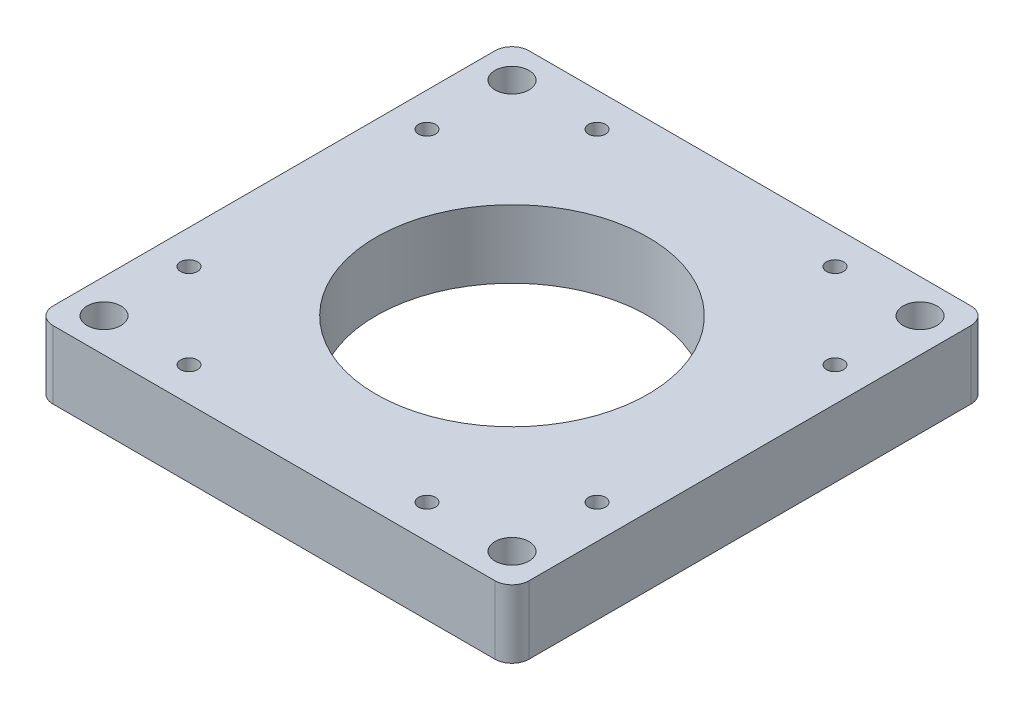
ISO-10303-21;
HEADER;
FILE_DESCRIPTION(('STEP AP214'),'2;1');
FILE_NAME('part.step','',(''),(''),'','','');
FILE_SCHEMA(('AUTOMOTIVE_DESIGN { 1 0 10303 214 1 1 1 1 }'));
ENDSEC;
DATA;
#1=APPLICATION_CONTEXT('core data for automotive mechanical design processes');
#2=APPLICATION_PROTOCOL_DEFINITION('international standard','automotive_design',2000,#1);
#3=PRODUCT_CONTEXT('',#1,'mechanical');
#4=PRODUCT('Part','Part','',(#3));
#5=PRODUCT_RELATED_PRODUCT_CATEGORY('part','',(#4));
#6=PRODUCT_DEFINITION_FORMATION('','',#4);
#7=PRODUCT_DEFINITION_CONTEXT('part definition',#1,'design');
#8=PRODUCT_DEFINITION('design','',#6,#7);
#9=PRODUCT_DEFINITION_SHAPE('','',#8);
#10=(LENGTH_UNIT() NAMED_UNIT(*) SI_UNIT(.MILLI.,.METRE.));
#11=(NAMED_UNIT(*) PLANE_ANGLE_UNIT() SI_UNIT($,.RADIAN.));
#12=(NAMED_UNIT(*) SI_UNIT($,.STERADIAN.) SOLID_ANGLE_UNIT());
#13=UNCERTAINTY_MEASURE_WITH_UNIT(LENGTH_MEASURE(1.E-05),#10,'distance_accuracy_value','');
#14=(GEOMETRIC_REPRESENTATION_CONTEXT(3) GLOBAL_UNCERTAINTY_ASSIGNED_CONTEXT((#13)) GLOBAL_UNIT_ASSIGNED_CONTEXT((#10,
#11,#12)) REPRESENTATION_CONTEXT('',''));
#15=CARTESIAN_POINT('',(0.,0.,0.));
#16=DIRECTION('',(0.,0.,1.));
#17=DIRECTION('',(1.,0.,0.));
#18=AXIS2_PLACEMENT_3D('',#15,#16,#17);
#19=CARTESIAN_POINT('',(0.,25.4,0.));
#20=DIRECTION('',(0.,1.,0.));
#21=DIRECTION('',(0.,0.,1.));
#22=AXIS2_PLACEMENT_3D('',#19,#20,#21);
#23=PLANE('',#22);
#24=CARTESIAN_POINT('',(-76.1999999999929,25.4,-44.4499999999985));
#25=DIRECTION('',(0.,1.,0.));
#26=DIRECTION('',(0.,0.,1.));
#27=AXIS2_PLACEMENT_3D('',#24,#25,#26);
#28=CIRCLE('',#27,3.17499999999998);
#29=CARTESIAN_POINT('',(-76.1999999999929,25.4,-41.2749999999985));
#30=VERTEX_POINT('',#29);
#31=EDGE_CURVE('E235',#30,#30,#28,.T.);
#32=ORIENTED_EDGE('',*,*,#31,.F.);
#33=EDGE_LOOP('',(#32));
#34=FACE_BOUND('',#33,.T.);
#35=CARTESIAN_POINT('',(-44.4499999999914,25.4,76.1999999999944));
#36=DIRECTION('',(0.,1.,0.));
#37=DIRECTION('',(0.,0.,1.));
#38=AXIS2_PLACEMENT_3D('',#35,#36,#37);
#39=CIRCLE('',#38,3.175);
#40=CARTESIAN_POINT('',(-44.4499999999914,25.4,79.3749999999944));
#41=VERTEX_POINT('',#40);
#42=EDGE_CURVE('E223',#41,#41,#39,.T.);
#43=ORIENTED_EDGE('',*,*,#42,.F.);
#44=EDGE_LOOP('',(#43));
#45=FACE_BOUND('',#44,.T.);
#46=CARTESIAN_POINT('',(76.2000000000015,25.4,44.4499999999929));
#47=DIRECTION('',(0.,1.,0.));
#48=DIRECTION('',(0.,0.,1.));
#49=AXIS2_PLACEMENT_3D('',#46,#47,#48);
#50=CIRCLE('',#49,3.175);
#51=CARTESIAN_POINT('',(76.2000000000015,25.4,47.6249999999929));
#52=VERTEX_POINT('',#51);
#53=EDGE_CURVE('E211',#52,#52,#50,.T.);
#54=ORIENTED_EDGE('',*,*,#53,.F.);
#55=EDGE_LOOP('',(#54));
#56=FACE_BOUND('',#55,.T.);
#57=CARTESIAN_POINT('',(76.2,25.4,76.2));
#58=DIRECTION('',(0.,1.,0.));
#59=DIRECTION('',(0.,0.,1.));
#60=AXIS2_PLACEMENT_3D('',#57,#58,#59);
#61=CIRCLE('',#60,6.34999999999999);
#62=CARTESIAN_POINT('',(76.2,25.4,82.55));
#63=VERTEX_POINT('',#62);
#64=EDGE_CURVE('E199',#63,#63,#61,.T.);
#65=ORIENTED_EDGE('',*,*,#64,.F.);
#66=EDGE_LOOP('',(#65));
#67=FACE_BOUND('',#66,.T.);
#68=CARTESIAN_POINT('',(-76.2,25.4,-76.2));
#69=DIRECTION('',(0.,1.,0.));
#70=DIRECTION('',(0.,0.,1.));
#71=AXIS2_PLACEMENT_3D('',#68,#69,#70);
#72=CIRCLE('',#71,6.34999999999999);
#73=CARTESIAN_POINT('',(-76.2,25.4,-69.85));
#74=VERTEX_POINT('',#73);
#75=EDGE_CURVE('E187',#74,#74,#72,.T.);
#76=ORIENTED_EDGE('',*,*,#75,.F.);
#77=EDGE_LOOP('',(#76));
#78=FACE_BOUND('',#77,.T.);
#79=CARTESIAN_POINT('',(44.45,25.4,-76.2));
#80=DIRECTION('',(0.,1.,0.));
#81=DIRECTION('',(0.,0.,1.));
#82=AXIS2_PLACEMENT_3D('',#79,#80,#81);
#83=CIRCLE('',#82,3.175);
#84=CARTESIAN_POINT('',(44.45,25.4,-73.025));
#85=VERTEX_POINT('',#84);
#86=EDGE_CURVE('E175',#85,#85,#83,.T.);
#87=ORIENTED_EDGE('',*,*,#86,.F.);
#88=EDGE_LOOP('',(#87));
#89=FACE_BOUND('',#88,.T.);
#90=DIRECTION('',(0.,0.,-1.));
#91=VECTOR('',#90,1.);
#92=CARTESIAN_POINT('',(88.9,25.4,88.9));
#93=LINE('',#92,#91);
#94=CARTESIAN_POINT('',(88.9,25.4,82.55));
#95=VERTEX_POINT('',#94);
#96=CARTESIAN_POINT('',(88.9,25.4,-82.55));
#97=VERTEX_POINT('',#96);
#98=EDGE_CURVE('E168',#95,#97,#93,.T.);
#99=ORIENTED_EDGE('',*,*,#98,.T.);
#100=CARTESIAN_POINT('',(82.55,25.4,-82.55));
#101=DIRECTION('',(0.,1.,0.));
#102=DIRECTION('',(0.,0.,1.));
#103=AXIS2_PLACEMENT_3D('',#100,#101,#102);
#104=CIRCLE('',#103,6.35);
#105=CARTESIAN_POINT('',(82.55,25.4,-88.9));
#106=VERTEX_POINT('',#105);
#107=EDGE_CURVE('E151',#97,#106,#104,.T.);
#108=ORIENTED_EDGE('',*,*,#107,.T.);
#109=DIRECTION('',(-1.,0.,0.));
#110=VECTOR('',#109,1.);
#111=CARTESIAN_POINT('',(88.9,25.4,-88.9));
#112=LINE('',#111,#110);
#113=CARTESIAN_POINT('',(-82.55,25.4,-88.9));
#114=VERTEX_POINT('',#113);
#115=EDGE_CURVE('E122',#106,#114,#112,.T.);
#116=ORIENTED_EDGE('',*,*,#115,.T.);
#117=CARTESIAN_POINT('',(-82.55,25.4,-82.55));
#118=DIRECTION('',(0.,1.,0.));
#119=DIRECTION('',(0.,0.,1.));
#120=AXIS2_PLACEMENT_3D('',#117,#118,#119);
#121=CIRCLE('',#120,6.35);
#122=CARTESIAN_POINT('',(-88.9,25.4,-82.55));
#123=VERTEX_POINT('',#122);
#124=EDGE_CURVE('E149',#114,#123,#121,.T.);
#125=ORIENTED_EDGE('',*,*,#124,.T.);
#126=DIRECTION('',(0.,0.,1.));
#127=VECTOR('',#126,1.);
#128=CARTESIAN_POINT('',(-88.9,25.4,88.9));
#129=LINE('',#128,#127);
#130=CARTESIAN_POINT('',(-88.9,25.4,82.55));
#131=VERTEX_POINT('',#130);
#132=EDGE_CURVE('E129',#123,#131,#129,.T.);
#133=ORIENTED_EDGE('',*,*,#132,.T.);
#134=CARTESIAN_POINT('',(-82.55,25.4,82.55));
#135=DIRECTION('',(0.,1.,0.));
#136=DIRECTION('',(0.,0.,1.));
#137=AXIS2_PLACEMENT_3D('',#134,#135,#136);
#138=CIRCLE('',#137,6.35);
#139=CARTESIAN_POINT('',(-82.55,25.4,88.9));
#140=VERTEX_POINT('',#139);
#141=EDGE_CURVE('E57',#131,#140,#138,.T.);
#142=ORIENTED_EDGE('',*,*,#141,.T.);
#143=DIRECTION('',(1.,0.,0.));
#144=VECTOR('',#143,1.);
#145=CARTESIAN_POINT('',(88.9,25.4,88.9));
#146=LINE('',#145,#144);
#147=CARTESIAN_POINT('',(82.55,25.4,88.9));
#148=VERTEX_POINT('',#147);
#149=EDGE_CURVE('E132',#140,#148,#146,.T.);
#150=ORIENTED_EDGE('',*,*,#149,.T.);
#151=CARTESIAN_POINT('',(82.55,25.4,82.55));
#152=DIRECTION('',(0.,1.,0.));
#153=DIRECTION('',(0.,0.,1.));
#154=AXIS2_PLACEMENT_3D('',#151,#152,#153);
#155=CIRCLE('',#154,6.35);
#156=EDGE_CURVE('E147',#148,#95,#155,.T.);
#157=ORIENTED_EDGE('',*,*,#156,.T.);
#158=EDGE_LOOP('',(#99,#108,#116,#125,#133,#142,#150,#157));
#159=FACE_BOUND('',#158,.T.);
#160=CARTESIAN_POINT('',(0.,25.4,0.));
#161=DIRECTION('',(0.,1.,0.));
#162=DIRECTION('',(0.,0.,1.));
#163=AXIS2_PLACEMENT_3D('',#160,#161,#162);
#164=CIRCLE('',#163,50.8);
#165=CARTESIAN_POINT('',(0.,25.4,50.8));
#166=VERTEX_POINT('',#165);
#167=EDGE_CURVE('E164',#166,#166,#164,.T.);
#168=ORIENTED_EDGE('',*,*,#167,.F.);
#169=EDGE_LOOP('',(#168));
#170=FACE_BOUND('',#169,.T.);
#171=CARTESIAN_POINT('',(-44.45,25.4,-76.2));
#172=DIRECTION('',(0.,1.,0.));
#173=DIRECTION('',(0.,0.,1.));
#174=AXIS2_PLACEMENT_3D('',#171,#172,#173);
#175=CIRCLE('',#174,3.175);
#176=CARTESIAN_POINT('',(-44.45,25.4,-73.025));
#177=VERTEX_POINT('',#176);
#178=EDGE_CURVE('E181',#177,#177,#175,.T.);
#179=ORIENTED_EDGE('',*,*,#178,.F.);
#180=EDGE_LOOP('',(#179));
#181=FACE_BOUND('',#180,.T.);
#182=CARTESIAN_POINT('',(-76.2,25.4,76.2));
#183=DIRECTION('',(0.,1.,0.));
#184=DIRECTION('',(0.,0.,1.));
#185=AXIS2_PLACEMENT_3D('',#182,#183,#184);
#186=CIRCLE('',#185,6.34999999999999);
#187=CARTESIAN_POINT('',(-76.2,25.4,82.55));
#188=VERTEX_POINT('',#187);
#189=EDGE_CURVE('E193',#188,#188,#186,.T.);
#190=ORIENTED_EDGE('',*,*,#189,.F.);
#191=EDGE_LOOP('',(#190));
#192=FACE_BOUND('',#191,.T.);
#193=CARTESIAN_POINT('',(76.2,25.4,-76.2));
#194=DIRECTION('',(0.,1.,0.));
#195=DIRECTION('',(0.,0.,1.));
#196=AXIS2_PLACEMENT_3D('',#193,#194,#195);
#197=CIRCLE('',#196,6.34999999999999);
#198=CARTESIAN_POINT('',(76.2,25.4,-69.85));
#199=VERTEX_POINT('',#198);
#200=EDGE_CURVE('E205',#199,#199,#197,.T.);
#201=ORIENTED_EDGE('',*,*,#200,.F.);
#202=EDGE_LOOP('',(#201));
#203=FACE_BOUND('',#202,.T.);
#204=CARTESIAN_POINT('',(76.2000000000015,25.4,-44.4500000000071));
#205=DIRECTION('',(0.,1.,0.));
#206=DIRECTION('',(0.,0.,1.));
#207=AXIS2_PLACEMENT_3D('',#204,#205,#206);
#208=CIRCLE('',#207,3.175);
#209=CARTESIAN_POINT('',(76.2000000000015,25.4,-41.2750000000071));
#210=VERTEX_POINT('',#209);
#211=EDGE_CURVE('E217',#210,#210,#208,.T.);
#212=ORIENTED_EDGE('',*,*,#211,.F.);
#213=EDGE_LOOP('',(#212));
#214=FACE_BOUND('',#213,.T.);
#215=CARTESIAN_POINT('',(44.4500000000086,25.4,76.1999999999944));
#216=DIRECTION('',(0.,1.,0.));
#217=DIRECTION('',(0.,0.,1.));
#218=AXIS2_PLACEMENT_3D('',#215,#216,#217);
#219=CIRCLE('',#218,3.175);
#220=CARTESIAN_POINT('',(44.4500000000086,25.4,79.3749999999944));
#221=VERTEX_POINT('',#220);
#222=EDGE_CURVE('E229',#221,#221,#219,.T.);
#223=ORIENTED_EDGE('',*,*,#222,.F.);
#224=EDGE_LOOP('',(#223));
#225=FACE_BOUND('',#224,.T.);
#226=CARTESIAN_POINT('',(-76.1999999999929,25.4,44.4500000000015));
#227=DIRECTION('',(0.,1.,0.));
#228=DIRECTION('',(0.,0.,1.));
#229=AXIS2_PLACEMENT_3D('',#226,#227,#228);
#230=CIRCLE('',#229,3.175);
#231=CARTESIAN_POINT('',(-76.1999999999929,25.4,47.6250000000015));
#232=VERTEX_POINT('',#231);
#233=EDGE_CURVE('E241',#232,#232,#230,.T.);
#234=ORIENTED_EDGE('',*,*,#233,.F.);
#235=EDGE_LOOP('',(#234));
#236=FACE_BOUND('',#235,.T.);
#237=ADVANCED_FACE('F37',(#34,#45,#56,#67,#78,#89,#159,#170,#181,#192,#203,#214,#225,#236),#23,.T.);
#238=CARTESIAN_POINT('',(0.,0.,0.));
#239=DIRECTION('',(0.,1.,0.));
#240=DIRECTION('',(0.,0.,1.));
#241=AXIS2_PLACEMENT_3D('',#238,#239,#240);
#242=PLANE('',#241);
#243=DIRECTION('',(-1.,0.,0.));
#244=VECTOR('',#243,1.);
#245=CARTESIAN_POINT('',(88.9,0.,-88.9));
#246=LINE('',#245,#244);
#247=CARTESIAN_POINT('',(82.55,0.,-88.9));
#248=VERTEX_POINT('',#247);
#249=CARTESIAN_POINT('',(-82.55,0.,-88.9));
#250=VERTEX_POINT('',#249);
#251=EDGE_CURVE('E119',#248,#250,#246,.T.);
#252=ORIENTED_EDGE('',*,*,#251,.F.);
#253=CARTESIAN_POINT('',(82.55,0.,-82.55));
#254=DIRECTION('',(0.,1.,0.));
#255=DIRECTION('',(0.,0.,1.));
#256=AXIS2_PLACEMENT_3D('',#253,#254,#255);
#257=CIRCLE('',#256,6.35);
#258=CARTESIAN_POINT('',(88.9,0.,-82.55));
#259=VERTEX_POINT('',#258);
#260=EDGE_CURVE('E102',#248,#259,#257,.F.);
#261=ORIENTED_EDGE('',*,*,#260,.T.);
#262=DIRECTION('',(0.,0.,-1.));
#263=VECTOR('',#262,1.);
#264=CARTESIAN_POINT('',(88.9,0.,88.9));
#265=LINE('',#264,#263);
#266=CARTESIAN_POINT('',(88.9,0.,82.55));
#267=VERTEX_POINT('',#266);
#268=EDGE_CURVE('E130',#267,#259,#265,.T.);
#269=ORIENTED_EDGE('',*,*,#268,.F.);
#270=CARTESIAN_POINT('',(82.55,0.,82.55));
#271=DIRECTION('',(0.,1.,0.));
#272=DIRECTION('',(0.,0.,1.));
#273=AXIS2_PLACEMENT_3D('',#270,#271,#272);
#274=CIRCLE('',#273,6.35);
#275=CARTESIAN_POINT('',(82.55,0.,88.9));
#276=VERTEX_POINT('',#275);
#277=EDGE_CURVE('E140',#267,#276,#274,.F.);
#278=ORIENTED_EDGE('',*,*,#277,.T.);
#279=DIRECTION('',(1.,0.,0.));
#280=VECTOR('',#279,1.);
#281=CARTESIAN_POINT('',(88.9,0.,88.9));
#282=LINE('',#281,#280);
#283=CARTESIAN_POINT('',(-82.55,0.,88.9));
#284=VERTEX_POINT('',#283);
#285=EDGE_CURVE('E134',#284,#276,#282,.T.);
#286=ORIENTED_EDGE('',*,*,#285,.F.);
#287=CARTESIAN_POINT('',(-82.55,0.,82.55));
#288=DIRECTION('',(0.,1.,0.));
#289=DIRECTION('',(0.,0.,1.));
#290=AXIS2_PLACEMENT_3D('',#287,#288,#289);
#291=CIRCLE('',#290,6.35);
#292=CARTESIAN_POINT('',(-88.9,0.,82.55));
#293=VERTEX_POINT('',#292);
#294=EDGE_CURVE('E123',#284,#293,#291,.F.);
#295=ORIENTED_EDGE('',*,*,#294,.T.);
#296=DIRECTION('',(0.,0.,1.));
#297=VECTOR('',#296,1.);
#298=CARTESIAN_POINT('',(-88.9,0.,88.9));
#299=LINE('',#298,#297);
#300=CARTESIAN_POINT('',(-88.9,0.,-82.55));
#301=VERTEX_POINT('',#300);
#302=EDGE_CURVE('E163',#301,#293,#299,.T.);
#303=ORIENTED_EDGE('',*,*,#302,.F.);
#304=CARTESIAN_POINT('',(-82.55,0.,-82.55));
#305=DIRECTION('',(0.,1.,0.));
#306=DIRECTION('',(0.,0.,1.));
#307=AXIS2_PLACEMENT_3D('',#304,#305,#306);
#308=CIRCLE('',#307,6.35);
#309=EDGE_CURVE('E113',#301,#250,#308,.F.);
#310=ORIENTED_EDGE('',*,*,#309,.T.);
#311=EDGE_LOOP('',(#252,#261,#269,#278,#286,#295,#303,#310));
#312=FACE_BOUND('',#311,.T.);
#313=CARTESIAN_POINT('',(0.,0.,0.));
#314=DIRECTION('',(0.,1.,0.));
#315=DIRECTION('',(0.,0.,1.));
#316=AXIS2_PLACEMENT_3D('',#313,#314,#315);
#317=CIRCLE('',#316,50.8);
#318=CARTESIAN_POINT('',(0.,0.,50.8));
#319=VERTEX_POINT('',#318);
#320=EDGE_CURVE('E172',#319,#319,#317,.T.);
#321=ORIENTED_EDGE('',*,*,#320,.T.);
#322=EDGE_LOOP('',(#321));
#323=FACE_BOUND('',#322,.T.);
#324=CARTESIAN_POINT('',(44.45,0.,-76.2));
#325=DIRECTION('',(0.,1.,0.));
#326=DIRECTION('',(0.,0.,1.));
#327=AXIS2_PLACEMENT_3D('',#324,#325,#326);
#328=CIRCLE('',#327,3.175);
#329=CARTESIAN_POINT('',(44.45,0.,-73.025));
#330=VERTEX_POINT('',#329);
#331=EDGE_CURVE('E178',#330,#330,#328,.T.);
#332=ORIENTED_EDGE('',*,*,#331,.T.);
#333=EDGE_LOOP('',(#332));
#334=FACE_BOUND('',#333,.T.);
#335=CARTESIAN_POINT('',(-44.45,0.,-76.2));
#336=DIRECTION('',(0.,1.,0.));
#337=DIRECTION('',(0.,0.,1.));
#338=AXIS2_PLACEMENT_3D('',#335,#336,#337);
#339=CIRCLE('',#338,3.175);
#340=CARTESIAN_POINT('',(-44.45,0.,-73.025));
#341=VERTEX_POINT('',#340);
#342=EDGE_CURVE('E184',#341,#341,#339,.T.);
#343=ORIENTED_EDGE('',*,*,#342,.T.);
#344=EDGE_LOOP('',(#343));
#345=FACE_BOUND('',#344,.T.);
#346=CARTESIAN_POINT('',(-76.2,0.,-76.2));
#347=DIRECTION('',(0.,1.,0.));
#348=DIRECTION('',(0.,0.,1.));
#349=AXIS2_PLACEMENT_3D('',#346,#347,#348);
#350=CIRCLE('',#349,6.34999999999999);
#351=CARTESIAN_POINT('',(-76.2,0.,-69.85));
#352=VERTEX_POINT('',#351);
#353=EDGE_CURVE('E190',#352,#352,#350,.T.);
#354=ORIENTED_EDGE('',*,*,#353,.T.);
#355=EDGE_LOOP('',(#354));
#356=FACE_BOUND('',#355,.T.);
#357=CARTESIAN_POINT('',(-76.2,0.,76.2));
#358=DIRECTION('',(0.,1.,0.));
#359=DIRECTION('',(0.,0.,1.));
#360=AXIS2_PLACEMENT_3D('',#357,#358,#359);
#361=CIRCLE('',#360,6.34999999999999);
#362=CARTESIAN_POINT('',(-76.2,0.,82.55));
#363=VERTEX_POINT('',#362);
#364=EDGE_CURVE('E196',#363,#363,#361,.T.);
#365=ORIENTED_EDGE('',*,*,#364,.T.);
#366=EDGE_LOOP('',(#365));
#367=FACE_BOUND('',#366,.T.);
#368=CARTESIAN_POINT('',(76.2,0.,76.2));
#369=DIRECTION('',(0.,1.,0.));
#370=DIRECTION('',(0.,0.,1.));
#371=AXIS2_PLACEMENT_3D('',#368,#369,#370);
#372=CIRCLE('',#371,6.34999999999999);
#373=CARTESIAN_POINT('',(76.2,0.,82.55));
#374=VERTEX_POINT('',#373);
#375=EDGE_CURVE('E202',#374,#374,#372,.T.);
#376=ORIENTED_EDGE('',*,*,#375,.T.);
#377=EDGE_LOOP('',(#376));
#378=FACE_BOUND('',#377,.T.);
#379=CARTESIAN_POINT('',(76.2,0.,-76.2));
#380=DIRECTION('',(0.,1.,0.));
#381=DIRECTION('',(0.,0.,1.));
#382=AXIS2_PLACEMENT_3D('',#379,#380,#381);
#383=CIRCLE('',#382,6.34999999999999);
#384=CARTESIAN_POINT('',(76.2,0.,-69.85));
#385=VERTEX_POINT('',#384);
#386=EDGE_CURVE('E208',#385,#385,#383,.T.);
#387=ORIENTED_EDGE('',*,*,#386,.T.);
#388=EDGE_LOOP('',(#387));
#389=FACE_BOUND('',#388,.T.);
#390=CARTESIAN_POINT('',(76.2000000000015,0.,44.4499999999929));
#391=DIRECTION('',(0.,1.,0.));
#392=DIRECTION('',(0.,0.,1.));
#393=AXIS2_PLACEMENT_3D('',#390,#391,#392);
#394=CIRCLE('',#393,3.175);
#395=CARTESIAN_POINT('',(76.2000000000015,0.,47.6249999999929));
#396=VERTEX_POINT('',#395);
#397=EDGE_CURVE('E214',#396,#396,#394,.T.);
#398=ORIENTED_EDGE('',*,*,#397,.T.);
#399=EDGE_LOOP('',(#398));
#400=FACE_BOUND('',#399,.T.);
#401=CARTESIAN_POINT('',(76.2000000000015,0.,-44.4500000000071));
#402=DIRECTION('',(0.,1.,0.));
#403=DIRECTION('',(0.,0.,1.));
#404=AXIS2_PLACEMENT_3D('',#401,#402,#403);
#405=CIRCLE('',#404,3.175);
#406=CARTESIAN_POINT('',(76.2000000000015,0.,-41.2750000000071));
#407=VERTEX_POINT('',#406);
#408=EDGE_CURVE('E220',#407,#407,#405,.T.);
#409=ORIENTED_EDGE('',*,*,#408,.T.);
#410=EDGE_LOOP('',(#409));
#411=FACE_BOUND('',#410,.T.);
#412=CARTESIAN_POINT('',(-44.4499999999914,0.,76.1999999999944));
#413=DIRECTION('',(0.,1.,0.));
#414=DIRECTION('',(0.,0.,1.));
#415=AXIS2_PLACEMENT_3D('',#412,#413,#414);
#416=CIRCLE('',#415,3.175);
#417=CARTESIAN_POINT('',(-44.4499999999914,0.,79.3749999999944));
#418=VERTEX_POINT('',#417);
#419=EDGE_CURVE('E226',#418,#418,#416,.T.);
#420=ORIENTED_EDGE('',*,*,#419,.T.);
#421=EDGE_LOOP('',(#420));
#422=FACE_BOUND('',#421,.T.);
#423=CARTESIAN_POINT('',(44.4500000000086,0.,76.1999999999944));
#424=DIRECTION('',(0.,1.,0.));
#425=DIRECTION('',(0.,0.,1.));
#426=AXIS2_PLACEMENT_3D('',#423,#424,#425);
#427=CIRCLE('',#426,3.175);
#428=CARTESIAN_POINT('',(44.4500000000086,0.,79.3749999999944));
#429=VERTEX_POINT('',#428);
#430=EDGE_CURVE('E232',#429,#429,#427,.T.);
#431=ORIENTED_EDGE('',*,*,#430,.T.);
#432=EDGE_LOOP('',(#431));
#433=FACE_BOUND('',#432,.T.);
#434=CARTESIAN_POINT('',(-76.1999999999929,0.,-44.4499999999985));
#435=DIRECTION('',(0.,1.,0.));
#436=DIRECTION('',(0.,0.,1.));
#437=AXIS2_PLACEMENT_3D('',#434,#435,#436);
#438=CIRCLE('',#437,3.17499999999998);
#439=CARTESIAN_POINT('',(-76.1999999999929,0.,-41.2749999999985));
#440=VERTEX_POINT('',#439);
#441=EDGE_CURVE('E238',#440,#440,#438,.T.);
#442=ORIENTED_EDGE('',*,*,#441,.T.);
#443=EDGE_LOOP('',(#442));
#444=FACE_BOUND('',#443,.T.);
#445=CARTESIAN_POINT('',(-76.1999999999929,0.,44.4500000000015));
#446=DIRECTION('',(0.,1.,0.));
#447=DIRECTION('',(0.,0.,1.));
#448=AXIS2_PLACEMENT_3D('',#445,#446,#447);
#449=CIRCLE('',#448,3.175);
#450=CARTESIAN_POINT('',(-76.1999999999929,0.,47.6250000000015));
#451=VERTEX_POINT('',#450);
#452=EDGE_CURVE('E244',#451,#451,#449,.T.);
#453=ORIENTED_EDGE('',*,*,#452,.T.);
#454=EDGE_LOOP('',(#453));
#455=FACE_BOUND('',#454,.T.);
#456=ADVANCED_FACE('F126',(#312,#323,#334,#345,#356,#367,#378,#389,#400,#411,#422,#433,#444,
#455),#242,.F.);
#457=CARTESIAN_POINT('',(-88.9,25.4,88.9));
#458=DIRECTION('',(1.,0.,0.));
#459=DIRECTION('',(0.,0.,-1.));
#460=AXIS2_PLACEMENT_3D('',#457,#458,#459);
#461=PLANE('',#460);
#462=ORIENTED_EDGE('',*,*,#132,.F.);
#463=DIRECTION('',(0.,-1.,0.));
#464=VECTOR('',#463,1.);
#465=CARTESIAN_POINT('',(-88.9,25.4,-82.55));
#466=LINE('',#465,#464);
#467=EDGE_CURVE('E155',#123,#301,#466,.T.);
#468=ORIENTED_EDGE('',*,*,#467,.T.);
#469=ORIENTED_EDGE('',*,*,#302,.T.);
#470=DIRECTION('',(0.,-1.,0.));
#471=VECTOR('',#470,1.);
#472=CARTESIAN_POINT('',(-88.9,25.4,82.55));
#473=LINE('',#472,#471);
#474=EDGE_CURVE('E153',#293,#131,#473,.F.);
#475=ORIENTED_EDGE('',*,*,#474,.T.);
#476=EDGE_LOOP('',(#462,#468,#469,#475));
#477=FACE_BOUND('',#476,.T.);
#478=ADVANCED_FACE('F259',(#477),#461,.F.);
#479=CARTESIAN_POINT('',(88.9,25.4,88.9));
#480=DIRECTION('',(0.,0.,-1.));
#481=DIRECTION('',(-1.,0.,0.));
#482=AXIS2_PLACEMENT_3D('',#479,#480,#481);
#483=PLANE('',#482);
#484=ORIENTED_EDGE('',*,*,#285,.T.);
#485=DIRECTION('',(0.,-1.,0.));
#486=VECTOR('',#485,1.);
#487=CARTESIAN_POINT('',(82.55,25.4,88.9));
#488=LINE('',#487,#486);
#489=EDGE_CURVE('E11',#276,#148,#488,.F.);
#490=ORIENTED_EDGE('',*,*,#489,.T.);
#491=ORIENTED_EDGE('',*,*,#149,.F.);
#492=DIRECTION('',(0.,-1.,0.));
#493=VECTOR('',#492,1.);
#494=CARTESIAN_POINT('',(-82.55,25.4,88.9));
#495=LINE('',#494,#493);
#496=EDGE_CURVE('E45',#140,#284,#495,.T.);
#497=ORIENTED_EDGE('',*,*,#496,.T.);
#498=EDGE_LOOP('',(#484,#490,#491,#497));
#499=FACE_BOUND('',#498,.T.);
#500=ADVANCED_FACE('F160',(#499),#483,.F.);
#501=CARTESIAN_POINT('',(88.9,25.4,88.9));
#502=DIRECTION('',(-1.,0.,0.));
#503=DIRECTION('',(0.,0.,1.));
#504=AXIS2_PLACEMENT_3D('',#501,#502,#503);
#505=PLANE('',#504);
#506=ORIENTED_EDGE('',*,*,#268,.T.);
#507=DIRECTION('',(0.,-1.,0.));
#508=VECTOR('',#507,1.);
#509=CARTESIAN_POINT('',(88.9,25.4,-82.55));
#510=LINE('',#509,#508);
#511=EDGE_CURVE('E107',#259,#97,#510,.F.);
#512=ORIENTED_EDGE('',*,*,#511,.T.);
#513=ORIENTED_EDGE('',*,*,#98,.F.);
#514=DIRECTION('',(0.,-1.,0.));
#515=VECTOR('',#514,1.);
#516=CARTESIAN_POINT('',(88.9,25.4,82.55));
#517=LINE('',#516,#515);
#518=EDGE_CURVE('E112',#95,#267,#517,.T.);
#519=ORIENTED_EDGE('',*,*,#518,.T.);
#520=EDGE_LOOP('',(#506,#512,#513,#519));
#521=FACE_BOUND('',#520,.T.);
#522=ADVANCED_FACE('F269',(#521),#505,.F.);
#523=CARTESIAN_POINT('',(88.9,25.4,-88.9));
#524=DIRECTION('',(0.,0.,1.));
#525=DIRECTION('',(1.,0.,0.));
#526=AXIS2_PLACEMENT_3D('',#523,#524,#525);
#527=PLANE('',#526);
#528=ORIENTED_EDGE('',*,*,#115,.F.);
#529=DIRECTION('',(0.,-1.,0.));
#530=VECTOR('',#529,1.);
#531=CARTESIAN_POINT('',(82.55,25.4,-88.9));
#532=LINE('',#531,#530);
#533=EDGE_CURVE('E106',#106,#248,#532,.T.);
#534=ORIENTED_EDGE('',*,*,#533,.T.);
#535=ORIENTED_EDGE('',*,*,#251,.T.);
#536=DIRECTION('',(0.,-1.,0.));
#537=VECTOR('',#536,1.);
#538=CARTESIAN_POINT('',(-82.55,25.4,-88.9));
#539=LINE('',#538,#537);
#540=EDGE_CURVE('E124',#250,#114,#539,.F.);
#541=ORIENTED_EDGE('',*,*,#540,.T.);
#542=EDGE_LOOP('',(#528,#534,#535,#541));
#543=FACE_BOUND('',#542,.T.);
#544=ADVANCED_FACE('F118',(#543),#527,.F.);
#545=CARTESIAN_POINT('',(0.,25.4,0.));
#546=DIRECTION('',(0.,-1.,0.));
#547=DIRECTION('',(0.,0.,-1.));
#548=AXIS2_PLACEMENT_3D('',#545,#546,#547);
#549=CYLINDRICAL_SURFACE('',#548,50.8);
#550=ORIENTED_EDGE('',*,*,#167,.T.);
#551=EDGE_LOOP('',(#550));
#552=FACE_BOUND('',#551,.T.);
#553=ORIENTED_EDGE('',*,*,#320,.F.);
#554=EDGE_LOOP('',(#553));
#555=FACE_BOUND('',#554,.T.);
#556=ADVANCED_FACE('F264',(#552,#555),#549,.F.);
#557=CARTESIAN_POINT('',(44.45,25.4,-76.2));
#558=DIRECTION('',(0.,-1.,0.));
#559=DIRECTION('',(0.,0.,-1.));
#560=AXIS2_PLACEMENT_3D('',#557,#558,#559);
#561=CYLINDRICAL_SURFACE('',#560,3.175);
#562=ORIENTED_EDGE('',*,*,#86,.T.);
#563=EDGE_LOOP('',(#562));
#564=FACE_BOUND('',#563,.T.);
#565=ORIENTED_EDGE('',*,*,#331,.F.);
#566=EDGE_LOOP('',(#565));
#567=FACE_BOUND('',#566,.T.);
#568=ADVANCED_FACE('F358',(#564,#567),#561,.F.);
#569=CARTESIAN_POINT('',(-44.45,25.4,-76.2));
#570=DIRECTION('',(0.,-1.,0.));
#571=DIRECTION('',(0.,0.,-1.));
#572=AXIS2_PLACEMENT_3D('',#569,#570,#571);
#573=CYLINDRICAL_SURFACE('',#572,3.175);
#574=ORIENTED_EDGE('',*,*,#178,.T.);
#575=EDGE_LOOP('',(#574));
#576=FACE_BOUND('',#575,.T.);
#577=ORIENTED_EDGE('',*,*,#342,.F.);
#578=EDGE_LOOP('',(#577));
#579=FACE_BOUND('',#578,.T.);
#580=ADVANCED_FACE('F355',(#576,#579),#573,.F.);
#581=CARTESIAN_POINT('',(-76.2,25.4,-76.2));
#582=DIRECTION('',(0.,-1.,0.));
#583=DIRECTION('',(0.,0.,-1.));
#584=AXIS2_PLACEMENT_3D('',#581,#582,#583);
#585=CYLINDRICAL_SURFACE('',#584,6.34999999999999);
#586=ORIENTED_EDGE('',*,*,#75,.T.);
#587=EDGE_LOOP('',(#586));
#588=FACE_BOUND('',#587,.T.);
#589=ORIENTED_EDGE('',*,*,#353,.F.);
#590=EDGE_LOOP('',(#589));
#591=FACE_BOUND('',#590,.T.);
#592=ADVANCED_FACE('F351',(#588,#591),#585,.F.);
#593=CARTESIAN_POINT('',(-76.2,25.4,76.2));
#594=DIRECTION('',(0.,-1.,0.));
#595=DIRECTION('',(0.,0.,-1.));
#596=AXIS2_PLACEMENT_3D('',#593,#594,#595);
#597=CYLINDRICAL_SURFACE('',#596,6.34999999999999);
#598=ORIENTED_EDGE('',*,*,#189,.T.);
#599=EDGE_LOOP('',(#598));
#600=FACE_BOUND('',#599,.T.);
#601=ORIENTED_EDGE('',*,*,#364,.F.);
#602=EDGE_LOOP('',(#601));
#603=FACE_BOUND('',#602,.T.);
#604=ADVANCED_FACE('F347',(#600,#603),#597,.F.);
#605=CARTESIAN_POINT('',(76.2,25.4,76.2));
#606=DIRECTION('',(0.,-1.,0.));
#607=DIRECTION('',(0.,0.,-1.));
#608=AXIS2_PLACEMENT_3D('',#605,#606,#607);
#609=CYLINDRICAL_SURFACE('',#608,6.34999999999999);
#610=ORIENTED_EDGE('',*,*,#64,.T.);
#611=EDGE_LOOP('',(#610));
#612=FACE_BOUND('',#611,.T.);
#613=ORIENTED_EDGE('',*,*,#375,.F.);
#614=EDGE_LOOP('',(#613));
#615=FACE_BOUND('',#614,.T.);
#616=ADVANCED_FACE('F343',(#612,#615),#609,.F.);
#617=CARTESIAN_POINT('',(76.2,25.4,-76.2));
#618=DIRECTION('',(0.,-1.,0.));
#619=DIRECTION('',(0.,0.,-1.));
#620=AXIS2_PLACEMENT_3D('',#617,#618,#619);
#621=CYLINDRICAL_SURFACE('',#620,6.34999999999999);
#622=ORIENTED_EDGE('',*,*,#200,.T.);
#623=EDGE_LOOP('',(#622));
#624=FACE_BOUND('',#623,.T.);
#625=ORIENTED_EDGE('',*,*,#386,.F.);
#626=EDGE_LOOP('',(#625));
#627=FACE_BOUND('',#626,.T.);
#628=ADVANCED_FACE('F339',(#624,#627),#621,.F.);
#629=CARTESIAN_POINT('',(76.2000000000015,25.4,44.4499999999929));
#630=DIRECTION('',(0.,-1.,0.));
#631=DIRECTION('',(0.,0.,-1.));
#632=AXIS2_PLACEMENT_3D('',#629,#630,#631);
#633=CYLINDRICAL_SURFACE('',#632,3.175);
#634=ORIENTED_EDGE('',*,*,#53,.T.);
#635=EDGE_LOOP('',(#634));
#636=FACE_BOUND('',#635,.T.);
#637=ORIENTED_EDGE('',*,*,#397,.F.);
#638=EDGE_LOOP('',(#637));
#639=FACE_BOUND('',#638,.T.);
#640=ADVANCED_FACE('F335',(#636,#639),#633,.F.);
#641=CARTESIAN_POINT('',(76.2000000000015,25.4,-44.4500000000071));
#642=DIRECTION('',(0.,-1.,0.));
#643=DIRECTION('',(0.,0.,-1.));
#644=AXIS2_PLACEMENT_3D('',#641,#642,#643);
#645=CYLINDRICAL_SURFACE('',#644,3.175);
#646=ORIENTED_EDGE('',*,*,#211,.T.);
#647=EDGE_LOOP('',(#646));
#648=FACE_BOUND('',#647,.T.);
#649=ORIENTED_EDGE('',*,*,#408,.F.);
#650=EDGE_LOOP('',(#649));
#651=FACE_BOUND('',#650,.T.);
#652=ADVANCED_FACE('F331',(#648,#651),#645,.F.);
#653=CARTESIAN_POINT('',(-44.4499999999914,25.4,76.1999999999944));
#654=DIRECTION('',(0.,-1.,0.));
#655=DIRECTION('',(0.,0.,-1.));
#656=AXIS2_PLACEMENT_3D('',#653,#654,#655);
#657=CYLINDRICAL_SURFACE('',#656,3.175);
#658=ORIENTED_EDGE('',*,*,#42,.T.);
#659=EDGE_LOOP('',(#658));
#660=FACE_BOUND('',#659,.T.);
#661=ORIENTED_EDGE('',*,*,#419,.F.);
#662=EDGE_LOOP('',(#661));
#663=FACE_BOUND('',#662,.T.);
#664=ADVANCED_FACE('F313',(#660,#663),#657,.F.);
#665=CARTESIAN_POINT('',(44.4500000000086,25.4,76.1999999999944));
#666=DIRECTION('',(0.,-1.,0.));
#667=DIRECTION('',(0.,0.,-1.));
#668=AXIS2_PLACEMENT_3D('',#665,#666,#667);
#669=CYLINDRICAL_SURFACE('',#668,3.175);
#670=ORIENTED_EDGE('',*,*,#222,.T.);
#671=EDGE_LOOP('',(#670));
#672=FACE_BOUND('',#671,.T.);
#673=ORIENTED_EDGE('',*,*,#430,.F.);
#674=EDGE_LOOP('',(#673));
#675=FACE_BOUND('',#674,.T.);
#676=ADVANCED_FACE('F309',(#672,#675),#669,.F.);
#677=CARTESIAN_POINT('',(-76.1999999999929,25.4,-44.4499999999985));
#678=DIRECTION('',(0.,-1.,0.));
#679=DIRECTION('',(0.,0.,-1.));
#680=AXIS2_PLACEMENT_3D('',#677,#678,#679);
#681=CYLINDRICAL_SURFACE('',#680,3.17499999999998);
#682=ORIENTED_EDGE('',*,*,#31,.T.);
#683=EDGE_LOOP('',(#682));
#684=FACE_BOUND('',#683,.T.);
#685=ORIENTED_EDGE('',*,*,#441,.F.);
#686=EDGE_LOOP('',(#685));
#687=FACE_BOUND('',#686,.T.);
#688=ADVANCED_FACE('F312',(#684,#687),#681,.F.);
#689=CARTESIAN_POINT('',(-76.1999999999929,25.4,44.4500000000015));
#690=DIRECTION('',(0.,-1.,0.));
#691=DIRECTION('',(0.,0.,-1.));
#692=AXIS2_PLACEMENT_3D('',#689,#690,#691);
#693=CYLINDRICAL_SURFACE('',#692,3.175);
#694=ORIENTED_EDGE('',*,*,#233,.T.);
#695=EDGE_LOOP('',(#694));
#696=FACE_BOUND('',#695,.T.);
#697=ORIENTED_EDGE('',*,*,#452,.F.);
#698=EDGE_LOOP('',(#697));
#699=FACE_BOUND('',#698,.T.);
#700=ADVANCED_FACE('F250',(#696,#699),#693,.F.);
#701=CARTESIAN_POINT('',(82.55,25.4,-82.55));
#702=DIRECTION('',(0.,-1.,0.));
#703=DIRECTION('',(0.,0.,-1.));
#704=AXIS2_PLACEMENT_3D('',#701,#702,#703);
#705=CYLINDRICAL_SURFACE('',#704,6.35);
#706=ORIENTED_EDGE('',*,*,#107,.F.);
#707=ORIENTED_EDGE('',*,*,#511,.F.);
#708=ORIENTED_EDGE('',*,*,#260,.F.);
#709=ORIENTED_EDGE('',*,*,#533,.F.);
#710=EDGE_LOOP('',(#706,#707,#708,#709));
#711=FACE_BOUND('',#710,.T.);
#712=ADVANCED_FACE('F105',(#711),#705,.T.);
#713=CARTESIAN_POINT('',(-82.55,25.4,-82.55));
#714=DIRECTION('',(0.,-1.,0.));
#715=DIRECTION('',(0.,0.,-1.));
#716=AXIS2_PLACEMENT_3D('',#713,#714,#715);
#717=CYLINDRICAL_SURFACE('',#716,6.35);
#718=ORIENTED_EDGE('',*,*,#124,.F.);
#719=ORIENTED_EDGE('',*,*,#540,.F.);
#720=ORIENTED_EDGE('',*,*,#309,.F.);
#721=ORIENTED_EDGE('',*,*,#467,.F.);
#722=EDGE_LOOP('',(#718,#719,#720,#721));
#723=FACE_BOUND('',#722,.T.);
#724=ADVANCED_FACE('F280',(#723),#717,.T.);
#725=CARTESIAN_POINT('',(82.55,25.4,82.55));
#726=DIRECTION('',(0.,-1.,0.));
#727=DIRECTION('',(0.,0.,-1.));
#728=AXIS2_PLACEMENT_3D('',#725,#726,#727);
#729=CYLINDRICAL_SURFACE('',#728,6.35);
#730=ORIENTED_EDGE('',*,*,#156,.F.);
#731=ORIENTED_EDGE('',*,*,#489,.F.);
#732=ORIENTED_EDGE('',*,*,#277,.F.);
#733=ORIENTED_EDGE('',*,*,#518,.F.);
#734=EDGE_LOOP('',(#730,#731,#732,#733));
#735=FACE_BOUND('',#734,.T.);
#736=ADVANCED_FACE('F282',(#735),#729,.T.);
#737=CARTESIAN_POINT('',(-82.55,25.4,82.55));
#738=DIRECTION('',(0.,-1.,0.));
#739=DIRECTION('',(0.,0.,-1.));
#740=AXIS2_PLACEMENT_3D('',#737,#738,#739);
#741=CYLINDRICAL_SURFACE('',#740,6.35);
#742=ORIENTED_EDGE('',*,*,#141,.F.);
#743=ORIENTED_EDGE('',*,*,#474,.F.);
#744=ORIENTED_EDGE('',*,*,#294,.F.);
#745=ORIENTED_EDGE('',*,*,#496,.F.);
#746=EDGE_LOOP('',(#742,#743,#744,#745));
#747=FACE_BOUND('',#746,.T.);
#748=ADVANCED_FACE('F39',(#747),#741,.T.);
#749=CLOSED_SHELL('',(#237,#456,#478,#500,#522,#544,#556,#568,#580,#592,#604,#616,#628,#640,
#652,#664,#676,#688,#700,#712,#724,#736,#748));
#750=MANIFOLD_SOLID_BREP('B2',#749);
#751=ADVANCED_BREP_SHAPE_REPRESENTATION('',(#18,#750),#14);
#752=SHAPE_DEFINITION_REPRESENTATION(#9,#751);
ENDSEC;
END-ISO-10303-21;
